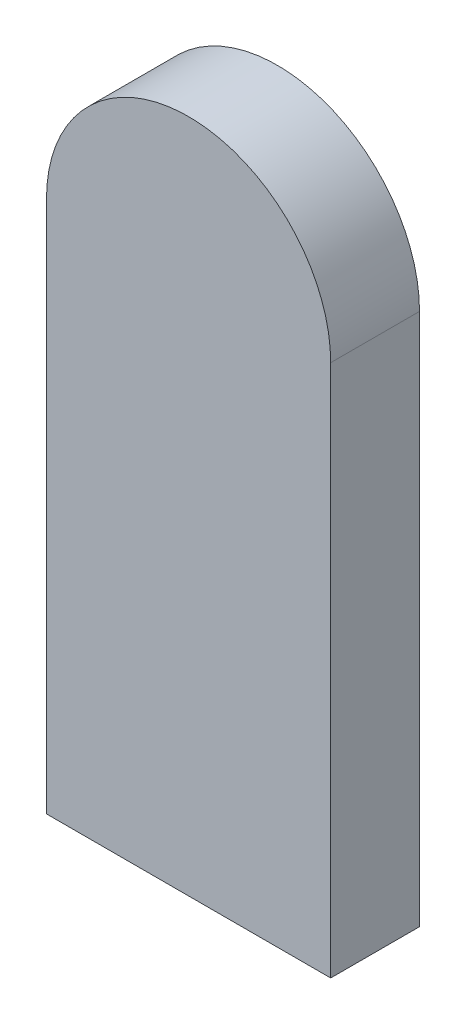
ISO-10303-21;
HEADER;
FILE_DESCRIPTION(('STEP AP214'),'2;1');
FILE_NAME('part.step','',(''),(''),'','','');
FILE_SCHEMA(('AUTOMOTIVE_DESIGN { 1 0 10303 214 1 1 1 1 }'));
ENDSEC;
DATA;
#1=APPLICATION_CONTEXT('core data for automotive mechanical design processes');
#2=APPLICATION_PROTOCOL_DEFINITION('international standard','automotive_design',2000,#1);
#3=PRODUCT_CONTEXT('',#1,'mechanical');
#4=PRODUCT('Part','Part','',(#3));
#5=PRODUCT_RELATED_PRODUCT_CATEGORY('part','',(#4));
#6=PRODUCT_DEFINITION_FORMATION('','',#4);
#7=PRODUCT_DEFINITION_CONTEXT('part definition',#1,'design');
#8=PRODUCT_DEFINITION('design','',#6,#7);
#9=PRODUCT_DEFINITION_SHAPE('','',#8);
#10=(LENGTH_UNIT() NAMED_UNIT(*) SI_UNIT(.MILLI.,.METRE.));
#11=(NAMED_UNIT(*) PLANE_ANGLE_UNIT() SI_UNIT($,.RADIAN.));
#12=(NAMED_UNIT(*) SI_UNIT($,.STERADIAN.) SOLID_ANGLE_UNIT());
#13=UNCERTAINTY_MEASURE_WITH_UNIT(LENGTH_MEASURE(1.E-05),#10,'distance_accuracy_value','');
#14=(GEOMETRIC_REPRESENTATION_CONTEXT(3) GLOBAL_UNCERTAINTY_ASSIGNED_CONTEXT((#13)) GLOBAL_UNIT_ASSIGNED_CONTEXT((#10,
#11,#12)) REPRESENTATION_CONTEXT('',''));
#15=CARTESIAN_POINT('',(0.,0.,0.));
#16=DIRECTION('',(0.,0.,1.));
#17=DIRECTION('',(1.,0.,0.));
#18=AXIS2_PLACEMENT_3D('',#15,#16,#17);
#19=CARTESIAN_POINT('',(0.,0.,25.));
#20=DIRECTION('',(0.,0.,-1.));
#21=DIRECTION('',(-1.,0.,0.));
#22=AXIS2_PLACEMENT_3D('',#19,#20,#21);
#23=CYLINDRICAL_SURFACE('',#22,40.);
#24=CARTESIAN_POINT('',(0.,0.,0.));
#25=DIRECTION('',(0.,0.,1.));
#26=DIRECTION('',(1.,0.,0.));
#27=AXIS2_PLACEMENT_3D('',#24,#25,#26);
#28=CIRCLE('',#27,40.);
#29=CARTESIAN_POINT('',(40.,0.,0.));
#30=VERTEX_POINT('',#29);
#31=CARTESIAN_POINT('',(-40.,0.,0.));
#32=VERTEX_POINT('',#31);
#33=EDGE_CURVE('E99',#30,#32,#28,.T.);
#34=ORIENTED_EDGE('',*,*,#33,.T.);
#35=DIRECTION('',(0.,0.,-1.));
#36=VECTOR('',#35,1.);
#37=CARTESIAN_POINT('',(-40.,0.,25.));
#38=LINE('',#37,#36);
#39=CARTESIAN_POINT('',(-40.,0.,25.));
#40=VERTEX_POINT('',#39);
#41=EDGE_CURVE('E11',#40,#32,#38,.T.);
#42=ORIENTED_EDGE('',*,*,#41,.F.);
#43=CARTESIAN_POINT('',(0.,0.,25.));
#44=DIRECTION('',(0.,0.,1.));
#45=DIRECTION('',(1.,0.,0.));
#46=AXIS2_PLACEMENT_3D('',#43,#44,#45);
#47=CIRCLE('',#46,40.);
#48=CARTESIAN_POINT('',(40.,0.,25.));
#49=VERTEX_POINT('',#48);
#50=EDGE_CURVE('E87',#49,#40,#47,.T.);
#51=ORIENTED_EDGE('',*,*,#50,.F.);
#52=DIRECTION('',(0.,0.,-1.));
#53=VECTOR('',#52,1.);
#54=CARTESIAN_POINT('',(40.,0.,25.));
#55=LINE('',#54,#53);
#56=EDGE_CURVE('E95',#49,#30,#55,.T.);
#57=ORIENTED_EDGE('',*,*,#56,.T.);
#58=EDGE_LOOP('',(#34,#42,#51,#57));
#59=FACE_BOUND('',#58,.T.);
#60=ADVANCED_FACE('F36',(#59),#23,.T.);
#61=CARTESIAN_POINT('',(-40.,0.,25.));
#62=DIRECTION('',(1.,0.,0.));
#63=DIRECTION('',(0.,0.,-1.));
#64=AXIS2_PLACEMENT_3D('',#61,#62,#63);
#65=PLANE('',#64);
#66=DIRECTION('',(0.,-1.,0.));
#67=VECTOR('',#66,1.);
#68=CARTESIAN_POINT('',(-40.,0.,0.));
#69=LINE('',#68,#67);
#70=CARTESIAN_POINT('',(-40.,-150.,0.));
#71=VERTEX_POINT('',#70);
#72=EDGE_CURVE('E91',#32,#71,#69,.T.);
#73=ORIENTED_EDGE('',*,*,#72,.T.);
#74=DIRECTION('',(0.,0.,-1.));
#75=VECTOR('',#74,1.);
#76=CARTESIAN_POINT('',(-40.,-150.,25.));
#77=LINE('',#76,#75);
#78=CARTESIAN_POINT('',(-40.,-150.,25.));
#79=VERTEX_POINT('',#78);
#80=EDGE_CURVE('E44',#79,#71,#77,.T.);
#81=ORIENTED_EDGE('',*,*,#80,.F.);
#82=DIRECTION('',(0.,-1.,0.));
#83=VECTOR('',#82,1.);
#84=CARTESIAN_POINT('',(-40.,0.,25.));
#85=LINE('',#84,#83);
#86=EDGE_CURVE('E82',#40,#79,#85,.T.);
#87=ORIENTED_EDGE('',*,*,#86,.F.);
#88=ORIENTED_EDGE('',*,*,#41,.T.);
#89=EDGE_LOOP('',(#73,#81,#87,#88));
#90=FACE_BOUND('',#89,.T.);
#91=ADVANCED_FACE('F90',(#90),#65,.F.);
#92=CARTESIAN_POINT('',(-40.,-150.,25.));
#93=DIRECTION('',(0.,1.,0.));
#94=DIRECTION('',(0.,0.,1.));
#95=AXIS2_PLACEMENT_3D('',#92,#93,#94);
#96=PLANE('',#95);
#97=DIRECTION('',(1.,0.,0.));
#98=VECTOR('',#97,1.);
#99=CARTESIAN_POINT('',(-40.,-150.,0.));
#100=LINE('',#99,#98);
#101=CARTESIAN_POINT('',(40.,-150.,0.));
#102=VERTEX_POINT('',#101);
#103=EDGE_CURVE('E69',#71,#102,#100,.T.);
#104=ORIENTED_EDGE('',*,*,#103,.T.);
#105=DIRECTION('',(0.,0.,-1.));
#106=VECTOR('',#105,1.);
#107=CARTESIAN_POINT('',(40.,-150.,25.));
#108=LINE('',#107,#106);
#109=CARTESIAN_POINT('',(40.,-150.,25.));
#110=VERTEX_POINT('',#109);
#111=EDGE_CURVE('E92',#110,#102,#108,.T.);
#112=ORIENTED_EDGE('',*,*,#111,.F.);
#113=DIRECTION('',(1.,0.,0.));
#114=VECTOR('',#113,1.);
#115=CARTESIAN_POINT('',(-40.,-150.,25.));
#116=LINE('',#115,#114);
#117=EDGE_CURVE('E85',#79,#110,#116,.T.);
#118=ORIENTED_EDGE('',*,*,#117,.F.);
#119=ORIENTED_EDGE('',*,*,#80,.T.);
#120=EDGE_LOOP('',(#104,#112,#118,#119));
#121=FACE_BOUND('',#120,.T.);
#122=ADVANCED_FACE('F93',(#121),#96,.F.);
#123=CARTESIAN_POINT('',(40.,0.,25.));
#124=DIRECTION('',(-1.,0.,0.));
#125=DIRECTION('',(0.,0.,1.));
#126=AXIS2_PLACEMENT_3D('',#123,#124,#125);
#127=PLANE('',#126);
#128=DIRECTION('',(0.,1.,0.));
#129=VECTOR('',#128,1.);
#130=CARTESIAN_POINT('',(40.,0.,0.));
#131=LINE('',#130,#129);
#132=EDGE_CURVE('E75',#102,#30,#131,.T.);
#133=ORIENTED_EDGE('',*,*,#132,.T.);
#134=ORIENTED_EDGE('',*,*,#56,.F.);
#135=DIRECTION('',(0.,1.,0.));
#136=VECTOR('',#135,1.);
#137=CARTESIAN_POINT('',(40.,0.,25.));
#138=LINE('',#137,#136);
#139=EDGE_CURVE('E52',#110,#49,#138,.T.);
#140=ORIENTED_EDGE('',*,*,#139,.F.);
#141=ORIENTED_EDGE('',*,*,#111,.T.);
#142=EDGE_LOOP('',(#133,#134,#140,#141));
#143=FACE_BOUND('',#142,.T.);
#144=ADVANCED_FACE('F106',(#143),#127,.F.);
#145=CARTESIAN_POINT('',(0.,0.,25.));
#146=DIRECTION('',(0.,0.,1.));
#147=DIRECTION('',(1.,0.,0.));
#148=AXIS2_PLACEMENT_3D('',#145,#146,#147);
#149=PLANE('',#148);
#150=ORIENTED_EDGE('',*,*,#50,.T.);
#151=ORIENTED_EDGE('',*,*,#86,.T.);
#152=ORIENTED_EDGE('',*,*,#117,.T.);
#153=ORIENTED_EDGE('',*,*,#139,.T.);
#154=EDGE_LOOP('',(#150,#151,#152,#153));
#155=FACE_BOUND('',#154,.T.);
#156=ADVANCED_FACE('F83',(#155),#149,.T.);
#157=CARTESIAN_POINT('',(0.,0.,0.));
#158=DIRECTION('',(0.,0.,1.));
#159=DIRECTION('',(1.,0.,0.));
#160=AXIS2_PLACEMENT_3D('',#157,#158,#159);
#161=PLANE('',#160);
#162=ORIENTED_EDGE('',*,*,#33,.F.);
#163=ORIENTED_EDGE('',*,*,#132,.F.);
#164=ORIENTED_EDGE('',*,*,#103,.F.);
#165=ORIENTED_EDGE('',*,*,#72,.F.);
#166=EDGE_LOOP('',(#162,#163,#164,#165));
#167=FACE_BOUND('',#166,.T.);
#168=ADVANCED_FACE('F109',(#167),#161,.F.);
#169=CLOSED_SHELL('',(#60,#91,#122,#144,#156,#168));
#170=MANIFOLD_SOLID_BREP('B2',#169);
#171=ADVANCED_BREP_SHAPE_REPRESENTATION('',(#18,#170),#14);
#172=SHAPE_DEFINITION_REPRESENTATION(#9,#171);
ENDSEC;
END-ISO-10303-21;
